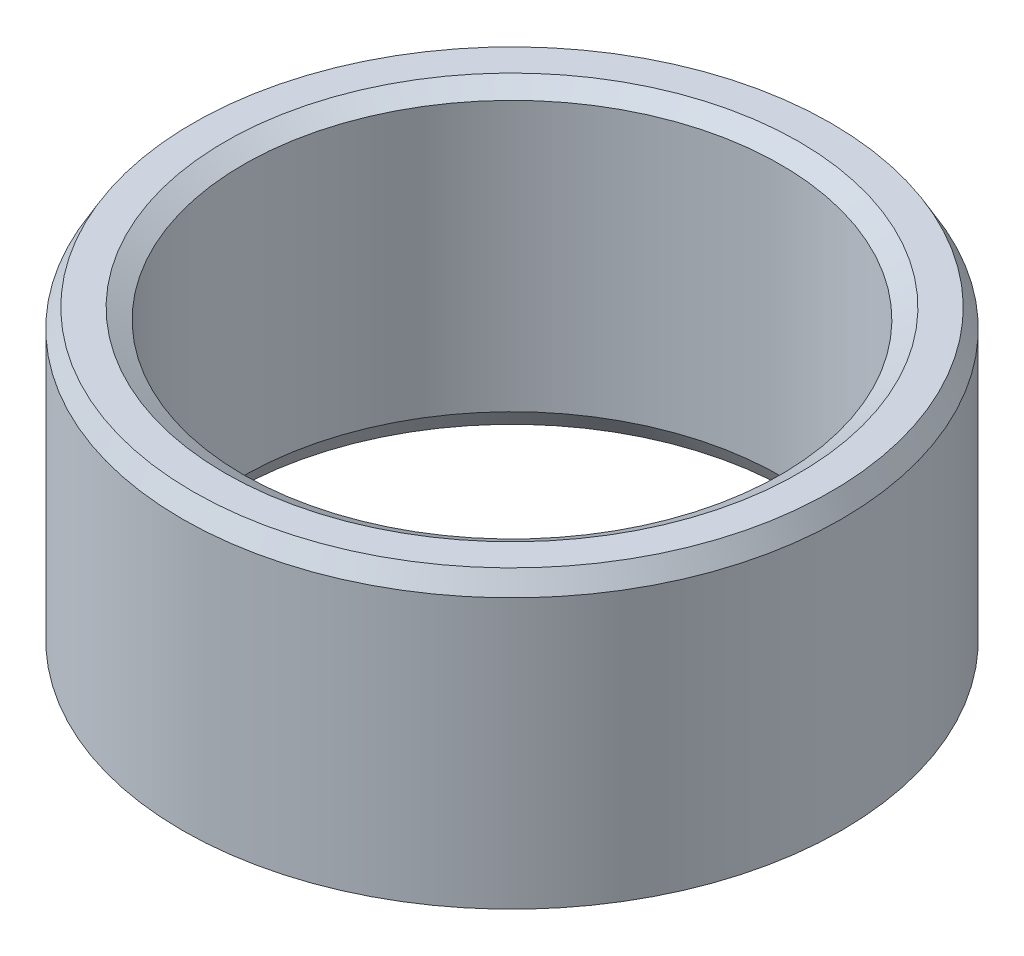
ISO-10303-21;
HEADER;
FILE_DESCRIPTION(('STEP AP214'),'2;1');
FILE_NAME('part.step','',(''),(''),'','','');
FILE_SCHEMA(('AUTOMOTIVE_DESIGN { 1 0 10303 214 1 1 1 1 }'));
ENDSEC;
DATA;
#1=APPLICATION_CONTEXT('core data for automotive mechanical design processes');
#2=APPLICATION_PROTOCOL_DEFINITION('international standard','automotive_design',2000,#1);
#3=PRODUCT_CONTEXT('',#1,'mechanical');
#4=PRODUCT('Part','Part','',(#3));
#5=PRODUCT_RELATED_PRODUCT_CATEGORY('part','',(#4));
#6=PRODUCT_DEFINITION_FORMATION('','',#4);
#7=PRODUCT_DEFINITION_CONTEXT('part definition',#1,'design');
#8=PRODUCT_DEFINITION('design','',#6,#7);
#9=PRODUCT_DEFINITION_SHAPE('','',#8);
#10=(LENGTH_UNIT() NAMED_UNIT(*) SI_UNIT(.MILLI.,.METRE.));
#11=(NAMED_UNIT(*) PLANE_ANGLE_UNIT() SI_UNIT($,.RADIAN.));
#12=(NAMED_UNIT(*) SI_UNIT($,.STERADIAN.) SOLID_ANGLE_UNIT());
#13=UNCERTAINTY_MEASURE_WITH_UNIT(LENGTH_MEASURE(1.E-05),#10,'distance_accuracy_value','');
#14=(GEOMETRIC_REPRESENTATION_CONTEXT(3) GLOBAL_UNCERTAINTY_ASSIGNED_CONTEXT((#13)) GLOBAL_UNIT_ASSIGNED_CONTEXT((#10,
#11,#12)) REPRESENTATION_CONTEXT('',''));
#15=CARTESIAN_POINT('',(0.,0.,0.));
#16=DIRECTION('',(0.,0.,1.));
#17=DIRECTION('',(1.,0.,0.));
#18=AXIS2_PLACEMENT_3D('',#15,#16,#17);
#19=CARTESIAN_POINT('',(0.,20.3848623304638,0.));
#20=DIRECTION('',(0.,-1.,0.));
#21=DIRECTION('',(0.,0.,-1.));
#22=AXIS2_PLACEMENT_3D('',#19,#20,#21);
#23=CYLINDRICAL_SURFACE('',#22,22.5);
#24=CARTESIAN_POINT('',(0.,0.725369740190954,0.));
#25=DIRECTION('',(0.,1.,0.));
#26=DIRECTION('',(0.,0.,1.));
#27=AXIS2_PLACEMENT_3D('',#24,#25,#26);
#28=CIRCLE('',#27,22.5);
#29=CARTESIAN_POINT('',(0.,0.725369740190954,22.5));
#30=VERTEX_POINT('',#29);
#31=EDGE_CURVE('E10',#30,#30,#28,.T.);
#32=ORIENTED_EDGE('',*,*,#31,.T.);
#33=EDGE_LOOP('',(#32));
#34=FACE_BOUND('',#33,.T.);
#35=CARTESIAN_POINT('',(0.,19.12848508618,0.));
#36=DIRECTION('',(0.,1.,0.));
#37=DIRECTION('',(0.,0.,1.));
#38=AXIS2_PLACEMENT_3D('',#35,#36,#37);
#39=CIRCLE('',#38,22.5);
#40=CARTESIAN_POINT('',(0.,19.12848508618,22.5));
#41=VERTEX_POINT('',#40);
#42=EDGE_CURVE('E50',#41,#41,#39,.F.);
#43=ORIENTED_EDGE('',*,*,#42,.T.);
#44=EDGE_LOOP('',(#43));
#45=FACE_BOUND('',#44,.T.);
#46=ADVANCED_FACE('F39',(#34,#45),#23,.T.);
#47=CARTESIAN_POINT('',(0.,20.3848623304638,0.));
#48=DIRECTION('',(0.,1.,0.));
#49=DIRECTION('',(0.,0.,1.));
#50=AXIS2_PLACEMENT_3D('',#47,#48,#49);
#51=PLANE('',#50);
#52=CARTESIAN_POINT('',(0.,20.3848623304638,0.));
#53=DIRECTION('',(0.,1.,0.));
#54=DIRECTION('',(0.,0.,1.));
#55=AXIS2_PLACEMENT_3D('',#52,#53,#54);
#56=CIRCLE('',#55,19.5885996671527);
#57=CARTESIAN_POINT('',(0.,20.3848623304638,19.5885996671527));
#58=VERTEX_POINT('',#57);
#59=EDGE_CURVE('E58',#58,#58,#56,.F.);
#60=ORIENTED_EDGE('',*,*,#59,.T.);
#61=EDGE_LOOP('',(#60));
#62=FACE_BOUND('',#61,.T.);
#63=CARTESIAN_POINT('',(0.,20.3848623304638,0.));
#64=DIRECTION('',(0.,1.,0.));
#65=DIRECTION('',(0.,0.,1.));
#66=AXIS2_PLACEMENT_3D('',#63,#64,#65);
#67=CIRCLE('',#66,21.7746302598091);
#68=CARTESIAN_POINT('',(0.,20.3848623304638,21.7746302598091));
#69=VERTEX_POINT('',#68);
#70=EDGE_CURVE('E61',#69,#69,#67,.T.);
#71=ORIENTED_EDGE('',*,*,#70,.T.);
#72=EDGE_LOOP('',(#71));
#73=FACE_BOUND('',#72,.T.);
#74=ADVANCED_FACE('F88',(#62,#73),#51,.T.);
#75=CARTESIAN_POINT('',(0.,0.,0.));
#76=DIRECTION('',(0.,1.,0.));
#77=DIRECTION('',(0.,0.,1.));
#78=AXIS2_PLACEMENT_3D('',#75,#76,#77);
#79=PLANE('',#78);
#80=CARTESIAN_POINT('',(0.,0.,0.));
#81=DIRECTION('',(0.,1.,0.));
#82=DIRECTION('',(0.,0.,1.));
#83=AXIS2_PLACEMENT_3D('',#80,#81,#82);
#84=CIRCLE('',#83,19.0575921630599);
#85=CARTESIAN_POINT('',(0.,0.,19.0575921630599));
#86=VERTEX_POINT('',#85);
#87=EDGE_CURVE('E51',#86,#86,#84,.T.);
#88=ORIENTED_EDGE('',*,*,#87,.T.);
#89=EDGE_LOOP('',(#88));
#90=FACE_BOUND('',#89,.T.);
#91=CARTESIAN_POINT('',(0.,0.,0.));
#92=DIRECTION('',(0.,1.,0.));
#93=DIRECTION('',(0.,0.,1.));
#94=AXIS2_PLACEMENT_3D('',#91,#92,#93);
#95=CIRCLE('',#94,21.2436227557162);
#96=CARTESIAN_POINT('',(0.,0.,21.2436227557162));
#97=VERTEX_POINT('',#96);
#98=EDGE_CURVE('E54',#97,#97,#95,.F.);
#99=ORIENTED_EDGE('',*,*,#98,.T.);
#100=EDGE_LOOP('',(#99));
#101=FACE_BOUND('',#100,.T.);
#102=ADVANCED_FACE('F83',(#90,#101),#79,.F.);
#103=CARTESIAN_POINT('',(0.,20.3848623304638,0.));
#104=DIRECTION('',(0.,-1.,0.));
#105=DIRECTION('',(0.,0.,-1.));
#106=AXIS2_PLACEMENT_3D('',#103,#104,#105);
#107=CYLINDRICAL_SURFACE('',#106,18.332222422869);
#108=CARTESIAN_POINT('',(0.,19.6594925902728,0.));
#109=DIRECTION('',(0.,1.,0.));
#110=DIRECTION('',(0.,0.,1.));
#111=AXIS2_PLACEMENT_3D('',#108,#109,#110);
#112=CIRCLE('',#111,18.332222422869);
#113=CARTESIAN_POINT('',(0.,19.6594925902728,18.332222422869));
#114=VERTEX_POINT('',#113);
#115=EDGE_CURVE('E67',#114,#114,#112,.T.);
#116=ORIENTED_EDGE('',*,*,#115,.T.);
#117=EDGE_LOOP('',(#116));
#118=FACE_BOUND('',#117,.T.);
#119=CARTESIAN_POINT('',(0.,1.25637724428376,0.));
#120=DIRECTION('',(0.,1.,0.));
#121=DIRECTION('',(0.,0.,1.));
#122=AXIS2_PLACEMENT_3D('',#119,#120,#121);
#123=CIRCLE('',#122,18.332222422869);
#124=CARTESIAN_POINT('',(0.,1.25637724428376,18.332222422869));
#125=VERTEX_POINT('',#124);
#126=EDGE_CURVE('E69',#125,#125,#123,.F.);
#127=ORIENTED_EDGE('',*,*,#126,.T.);
#128=EDGE_LOOP('',(#127));
#129=FACE_BOUND('',#128,.T.);
#130=ADVANCED_FACE('F71',(#118,#129),#107,.F.);
#131=CARTESIAN_POINT('',(0.,19.6594925902728,0.));
#132=DIRECTION('',(0.,1.,0.));
#133=DIRECTION('',(0.,0.,1.));
#134=AXIS2_PLACEMENT_3D('',#131,#132,#133);
#135=CONICAL_SURFACE('',#134,18.332222422869,1.0471975511966);
#136=CARTESIAN_POINT('',(0.,20.3848623304638,19.5885996671527));
#137=CARTESIAN_POINT('',(0.,20.3773063956701,19.5755124041914));
#138=CARTESIAN_POINT('',(0.,20.3697504608765,19.5624251412302));
#139=CARTESIAN_POINT('',(0.,20.3546385912892,19.5362506153076));
#140=CARTESIAN_POINT('',(0.,20.3470826564955,19.5231633523463));
#141=CARTESIAN_POINT('',(0.,20.3319707869082,19.4969888264237));
#142=CARTESIAN_POINT('',(0.,20.3244148521145,19.4839015634624));
#143=CARTESIAN_POINT('',(0.,20.3093029825272,19.4577270375398));
#144=CARTESIAN_POINT('',(0.,20.3017470477336,19.4446397745786));
#145=CARTESIAN_POINT('',(0.,20.2866351781462,19.418465248656));
#146=CARTESIAN_POINT('',(0.,20.2790792433526,19.4053779856947));
#147=CARTESIAN_POINT('',(0.,20.2639673737653,19.3792034597721));
#148=CARTESIAN_POINT('',(0.,20.2564114389716,19.3661161968108));
#149=CARTESIAN_POINT('',(0.,20.2412995693843,19.3399416708882));
#150=CARTESIAN_POINT('',(0.,20.2337436345907,19.326854407927));
#151=CARTESIAN_POINT('',(0.,20.2186317650033,19.3006798820044));
#152=CARTESIAN_POINT('',(0.,20.2110758302097,19.2875926190431));
#153=CARTESIAN_POINT('',(0.,20.1959639606224,19.2614180931205));
#154=CARTESIAN_POINT('',(0.,20.1884080258287,19.2483308301592));
#155=CARTESIAN_POINT('',(0.,20.1732961562414,19.2221563042366));
#156=CARTESIAN_POINT('',(0.,20.1657402214478,19.2090690412753));
#157=CARTESIAN_POINT('',(0.,20.1506283518604,19.1828945153528));
#158=CARTESIAN_POINT('',(0.,20.1430724170668,19.1698072523915));
#159=CARTESIAN_POINT('',(0.,20.1279605474795,19.1436327264689));
#160=CARTESIAN_POINT('',(0.,20.1204046126858,19.1305454635076));
#161=CARTESIAN_POINT('',(0.,20.1052927430985,19.104370937585));
#162=CARTESIAN_POINT('',(0.,20.0977368083049,19.0912836746237));
#163=CARTESIAN_POINT('',(0.,20.0826249387175,19.0651091487012));
#164=CARTESIAN_POINT('',(0.,20.0750690039239,19.0520218857399));
#165=CARTESIAN_POINT('',(0.,20.0599571343366,19.0258473598173));
#166=CARTESIAN_POINT('',(0.,20.0524011995429,19.012760096856));
#167=CARTESIAN_POINT('',(0.,20.0372893299556,18.9865855709334));
#168=CARTESIAN_POINT('',(0.,20.029733395162,18.9734983079721));
#169=CARTESIAN_POINT('',(0.,20.0146215255746,18.9473237820496));
#170=CARTESIAN_POINT('',(0.,20.007065590781,18.9342365190883));
#171=CARTESIAN_POINT('',(0.,19.9919537211937,18.9080619931657));
#172=CARTESIAN_POINT('',(0.,19.9843977864,18.8949747302044));
#173=CARTESIAN_POINT('',(0.,19.9692859168127,18.8688002042818));
#174=CARTESIAN_POINT('',(0.,19.9617299820191,18.8557129413205));
#175=CARTESIAN_POINT('',(0.,19.9466181124317,18.829538415398));
#176=CARTESIAN_POINT('',(0.,19.9390621776381,18.8164511524367));
#177=CARTESIAN_POINT('',(0.,19.9239503080508,18.7902766265141));
#178=CARTESIAN_POINT('',(0.,19.9163943732571,18.7771893635528));
#179=CARTESIAN_POINT('',(0.,19.9012825036698,18.7510148376302));
#180=CARTESIAN_POINT('',(0.,19.8937265688761,18.7379275746689));
#181=CARTESIAN_POINT('',(0.,19.8786146992888,18.7117530487464));
#182=CARTESIAN_POINT('',(0.,19.8710587644952,18.6986657857851));
#183=CARTESIAN_POINT('',(0.,19.8559468949079,18.6724912598625));
#184=CARTESIAN_POINT('',(0.,19.8483909601142,18.6594039969012));
#185=CARTESIAN_POINT('',(0.,19.8332790905269,18.6332294709786));
#186=CARTESIAN_POINT('',(0.,19.8257231557332,18.6201422080173));
#187=CARTESIAN_POINT('',(0.,19.8106112861459,18.5939676820948));
#188=CARTESIAN_POINT('',(0.,19.8030553513523,18.5808804191335));
#189=CARTESIAN_POINT('',(0.,19.787943481765,18.5547058932109));
#190=CARTESIAN_POINT('',(0.,19.7803875469713,18.5416186302496));
#191=CARTESIAN_POINT('',(0.,19.765275677384,18.515444104327));
#192=CARTESIAN_POINT('',(0.,19.7577197425903,18.5023568413657));
#193=CARTESIAN_POINT('',(0.,19.742607873003,18.4761823154431));
#194=CARTESIAN_POINT('',(0.,19.7350519382094,18.4630950524819));
#195=CARTESIAN_POINT('',(0.,19.7199400686221,18.4369205265593));
#196=CARTESIAN_POINT('',(0.,19.7123841338284,18.423833263598));
#197=CARTESIAN_POINT('',(0.,19.6972722642411,18.3976587376754));
#198=CARTESIAN_POINT('',(0.,19.6897163294474,18.3845714747141));
#199=CARTESIAN_POINT('',(0.,19.6746044598601,18.3583969487915));
#200=CARTESIAN_POINT('',(0.,19.6670485250665,18.3453096858303));
#201=CARTESIAN_POINT('',(0.,19.6594925902728,18.332222422869));
#202=B_SPLINE_CURVE_WITH_KNOTS('',3,(#136,#137,#138,#139,#140,#141,#142,#143,#144,#145,#146,
#147,#148,#149,#150,#151,#152,#153,#154,#155,#156,#157,#158,#159,#160,#161,#162,#163,#164,#165,
#166,#167,#168,#169,#170,#171,#172,#173,#174,#175,#176,#177,#178,#179,#180,#181,#182,#183,#184,
#185,#186,#187,#188,#189,#190,#191,#192,#193,#194,#195,#196,#197,#198,#199,#200,#201),
.UNSPECIFIED.,.F.,.F.,(4,2,2,2,2,2,2,2,2,2,2,2,2,2,2,2,2,2,2,2,2,2,2,2,2,2,2,2,2,2,2,2,4),(0.,
0.0453356087619344,0.0906712175238687,0.136006826285804,0.181342435047739,0.226678043809673,
0.272013652571606,0.31734926133354,0.362684870095476,0.40802047885741,0.453356087619345,
0.49869169638128,0.544027305143215,0.589362913905149,0.634698522667082,0.680034131429019,
0.725369740190952,0.770705348952886,0.816040957714821,0.861376566476756,0.906712175238691,
0.952047784000625,0.997383392762558,1.0427190015245,1.08805461028643,1.13339021904836,
1.1787258278103,1.22406143657223,1.26939704533417,1.3147326540961,1.36006826285803,
1.40540387161997,1.4507394803819),.UNSPECIFIED.);
#203=EDGE_CURVE('BSEAM77',#58,#114,#202,.T.);
#204=ORIENTED_EDGE('',*,*,#59,.F.);
#205=ORIENTED_EDGE('',*,*,#115,.F.);
#206=ORIENTED_EDGE('',*,*,#203,.T.);
#207=ORIENTED_EDGE('',*,*,#203,.F.);
#208=EDGE_LOOP('',(#204,#206,#205,#207));
#209=FACE_BOUND('',#208,.T.);
#210=ADVANCED_FACE('F77',(#209),#135,.F.);
#211=CARTESIAN_POINT('',(0.,0.,0.));
#212=DIRECTION('',(0.,-1.,0.));
#213=DIRECTION('',(0.,0.,-1.));
#214=AXIS2_PLACEMENT_3D('',#211,#212,#213);
#215=CONICAL_SURFACE('',#214,19.0575921630599,0.523598775598299);
#216=ORIENTED_EDGE('',*,*,#126,.F.);
#217=EDGE_LOOP('',(#216));
#218=FACE_BOUND('',#217,.T.);
#219=ORIENTED_EDGE('',*,*,#87,.F.);
#220=EDGE_LOOP('',(#219));
#221=FACE_BOUND('',#220,.T.);
#222=ADVANCED_FACE('F73',(#218,#221),#215,.F.);
#223=CARTESIAN_POINT('',(0.,0.725369740190954,0.));
#224=DIRECTION('',(0.,1.,0.));
#225=DIRECTION('',(0.,0.,1.));
#226=AXIS2_PLACEMENT_3D('',#223,#224,#225);
#227=CONICAL_SURFACE('',#226,22.5,1.0471975511966);
#228=CARTESIAN_POINT('',(0.,0.,21.2436227557162));
#229=CARTESIAN_POINT('',(0.,0.00755593479365649,21.2567100186775));
#230=CARTESIAN_POINT('',(0.,0.015111869587312,21.2697972816388));
#231=CARTESIAN_POINT('',(0.,0.0302237391746229,21.2959718075614));
#232=CARTESIAN_POINT('',(0.,0.0377796739682784,21.3090590705227));
#233=CARTESIAN_POINT('',(0.,0.0528915435555901,21.3352335964452));
#234=CARTESIAN_POINT('',(0.,0.0604474783492463,21.3483208594065));
#235=CARTESIAN_POINT('',(0.,0.0755593479365578,21.3744953853291));
#236=CARTESIAN_POINT('',(0.,0.0831152827302132,21.3875826482904));
#237=CARTESIAN_POINT('',(0.,0.0982271523175245,21.413757174213));
#238=CARTESIAN_POINT('',(0.,0.10578308711118,21.4268444371743));
#239=CARTESIAN_POINT('',(0.,0.120894956698492,21.4530189630969));
#240=CARTESIAN_POINT('',(0.,0.128450891492148,21.4661062260581));
#241=CARTESIAN_POINT('',(0.,0.14356276107946,21.4922807519807));
#242=CARTESIAN_POINT('',(0.,0.151118695873115,21.505368014942));
#243=CARTESIAN_POINT('',(0.,0.166230565460427,21.5315425408646));
#244=CARTESIAN_POINT('',(0.,0.173786500254083,21.5446298038259));
#245=CARTESIAN_POINT('',(0.,0.188898369841394,21.5708043297485));
#246=CARTESIAN_POINT('',(0.,0.19645430463505,21.5838915927097));
#247=CARTESIAN_POINT('',(0.,0.211566174222361,21.6100661186323));
#248=CARTESIAN_POINT('',(0.,0.219122109016017,21.6231533815936));
#249=CARTESIAN_POINT('',(0.,0.234233978603329,21.6493279075162));
#250=CARTESIAN_POINT('',(0.,0.241789913396985,21.6624151704775));
#251=CARTESIAN_POINT('',(0.,0.256901782984296,21.6885896964001));
#252=CARTESIAN_POINT('',(0.,0.264457717777952,21.7016769593614));
#253=CARTESIAN_POINT('',(0.,0.279569587365263,21.7278514852839));
#254=CARTESIAN_POINT('',(0.,0.287125522158919,21.7409387482452));
#255=CARTESIAN_POINT('',(0.,0.302237391746231,21.7671132741678));
#256=CARTESIAN_POINT('',(0.,0.309793326539886,21.7802005371291));
#257=CARTESIAN_POINT('',(0.,0.324905196127198,21.8063750630517));
#258=CARTESIAN_POINT('',(0.,0.332461130920853,21.819462326013));
#259=CARTESIAN_POINT('',(0.,0.347573000508165,21.8456368519355));
#260=CARTESIAN_POINT('',(0.,0.355128935301821,21.8587241148968));
#261=CARTESIAN_POINT('',(0.,0.370240804889133,21.8848986408194));
#262=CARTESIAN_POINT('',(0.,0.377796739682788,21.8979859037807));
#263=CARTESIAN_POINT('',(0.,0.3929086092701,21.9241604297033));
#264=CARTESIAN_POINT('',(0.,0.400464544063756,21.9372476926646));
#265=CARTESIAN_POINT('',(0.,0.415576413651067,21.9634222185871));
#266=CARTESIAN_POINT('',(0.,0.423132348444723,21.9765094815484));
#267=CARTESIAN_POINT('',(0.,0.438244218032034,22.002684007471));
#268=CARTESIAN_POINT('',(0.,0.44580015282569,22.0157712704323));
#269=CARTESIAN_POINT('',(0.,0.460912022413002,22.0419457963549));
#270=CARTESIAN_POINT('',(0.,0.468467957206658,22.0550330593162));
#271=CARTESIAN_POINT('',(0.,0.483579826793969,22.0812075852387));
#272=CARTESIAN_POINT('',(0.,0.491135761587625,22.0942948482));
#273=CARTESIAN_POINT('',(0.,0.506247631174936,22.1204693741226));
#274=CARTESIAN_POINT('',(0.,0.513803565968592,22.1335566370839));
#275=CARTESIAN_POINT('',(0.,0.528915435555904,22.1597311630065));
#276=CARTESIAN_POINT('',(0.,0.536471370349559,22.1728184259678));
#277=CARTESIAN_POINT('',(0.,0.551583239936871,22.1989929518904));
#278=CARTESIAN_POINT('',(0.,0.559139174730527,22.2120802148516));
#279=CARTESIAN_POINT('',(0.,0.574251044317838,22.2382547407742));
#280=CARTESIAN_POINT('',(0.,0.581806979111494,22.2513420037355));
#281=CARTESIAN_POINT('',(0.,0.596918848698805,22.2775165296581));
#282=CARTESIAN_POINT('',(0.,0.604474783492461,22.2906037926194));
#283=CARTESIAN_POINT('',(0.,0.619586653079773,22.316778318542));
#284=CARTESIAN_POINT('',(0.,0.627142587873429,22.3298655815032));
#285=CARTESIAN_POINT('',(0.,0.64225445746074,22.3560401074258));
#286=CARTESIAN_POINT('',(0.,0.649810392254396,22.3691273703871));
#287=CARTESIAN_POINT('',(0.,0.664922261841707,22.3953018963097));
#288=CARTESIAN_POINT('',(0.,0.672478196635363,22.408389159271));
#289=CARTESIAN_POINT('',(0.,0.687590066222675,22.4345636851936));
#290=CARTESIAN_POINT('',(0.,0.695146001016331,22.4476509481548));
#291=CARTESIAN_POINT('',(0.,0.710257870603642,22.4738254740774));
#292=CARTESIAN_POINT('',(0.,0.717813805397297,22.4869127370387));
#293=CARTESIAN_POINT('',(0.,0.725369740190954,22.5));
#294=B_SPLINE_CURVE_WITH_KNOTS('',3,(#228,#229,#230,#231,#232,#233,#234,#235,#236,#237,#238,
#239,#240,#241,#242,#243,#244,#245,#246,#247,#248,#249,#250,#251,#252,#253,#254,#255,#256,#257,
#258,#259,#260,#261,#262,#263,#264,#265,#266,#267,#268,#269,#270,#271,#272,#273,#274,#275,#276,
#277,#278,#279,#280,#281,#282,#283,#284,#285,#286,#287,#288,#289,#290,#291,#292,#293),
.UNSPECIFIED.,.F.,.F.,(4,2,2,2,2,2,2,2,2,2,2,2,2,2,2,2,2,2,2,2,2,2,2,2,2,2,2,2,2,2,2,2,4),(0.,
0.0453356087619337,0.0906712175238704,0.136006826285804,0.181342435047741,0.226678043809675,
0.272013652571608,0.317349261333545,0.362684870095479,0.408020478857415,0.453356087619349,
0.498691696381283,0.54402730514322,0.589362913905153,0.63469852266709,0.680034131429024,
0.725369740190958,0.770705348952894,0.816040957714828,0.861376566476765,0.906712175238699,
0.952047784000632,0.997383392762569,1.0427190015245,1.08805461028644,1.13339021904837,
1.17872582781031,1.22406143657224,1.26939704533418,1.31473265409611,1.36006826285805,
1.40540387161998,1.45073948038192),.UNSPECIFIED.);
#295=EDGE_CURVE('BSEAM76',#97,#30,#294,.T.);
#296=ORIENTED_EDGE('',*,*,#98,.F.);
#297=ORIENTED_EDGE('',*,*,#31,.F.);
#298=ORIENTED_EDGE('',*,*,#295,.T.);
#299=ORIENTED_EDGE('',*,*,#295,.F.);
#300=EDGE_LOOP('',(#296,#298,#297,#299));
#301=FACE_BOUND('',#300,.T.);
#302=ADVANCED_FACE('F76',(#301),#227,.T.);
#303=CARTESIAN_POINT('',(0.,20.3848623304638,0.));
#304=DIRECTION('',(0.,-1.,0.));
#305=DIRECTION('',(0.,0.,-1.));
#306=AXIS2_PLACEMENT_3D('',#303,#304,#305);
#307=CONICAL_SURFACE('',#306,21.7746302598091,0.523598775598294);
#308=ORIENTED_EDGE('',*,*,#42,.F.);
#309=EDGE_LOOP('',(#308));
#310=FACE_BOUND('',#309,.T.);
#311=ORIENTED_EDGE('',*,*,#70,.F.);
#312=EDGE_LOOP('',(#311));
#313=FACE_BOUND('',#312,.T.);
#314=ADVANCED_FACE('F45',(#310,#313),#307,.T.);
#315=CLOSED_SHELL('',(#46,#74,#102,#130,#210,#222,#302,#314));
#316=MANIFOLD_SOLID_BREP('B2',#315);
#317=ADVANCED_BREP_SHAPE_REPRESENTATION('',(#18,#316),#14);
#318=SHAPE_DEFINITION_REPRESENTATION(#9,#317);
ENDSEC;
END-ISO-10303-21;
